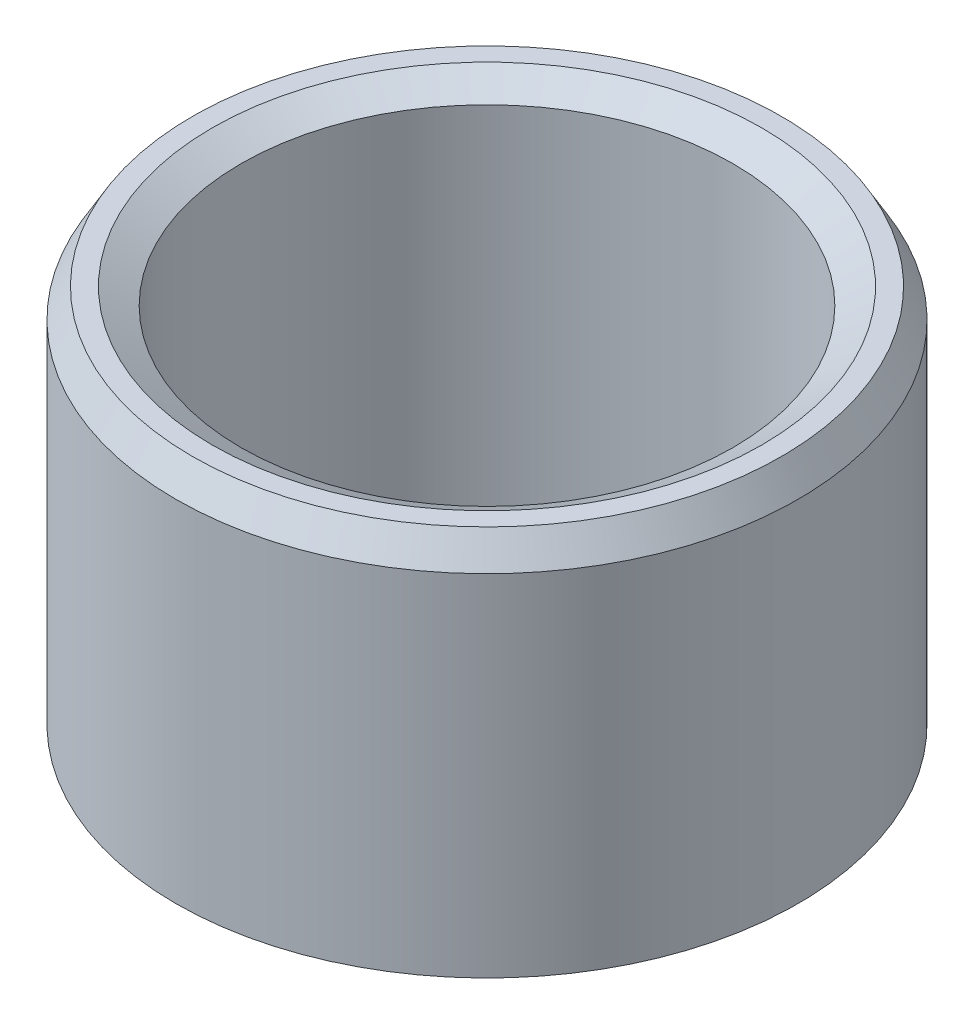
ISO-10303-21;
HEADER;
FILE_DESCRIPTION(('STEP AP214'),'2;1');
FILE_NAME('part.step','',(''),(''),'','','');
FILE_SCHEMA(('AUTOMOTIVE_DESIGN { 1 0 10303 214 1 1 1 1 }'));
ENDSEC;
DATA;
#1=APPLICATION_CONTEXT('core data for automotive mechanical design processes');
#2=APPLICATION_PROTOCOL_DEFINITION('international standard','automotive_design',2000,#1);
#3=PRODUCT_CONTEXT('',#1,'mechanical');
#4=PRODUCT('Part','Part','',(#3));
#5=PRODUCT_RELATED_PRODUCT_CATEGORY('part','',(#4));
#6=PRODUCT_DEFINITION_FORMATION('','',#4);
#7=PRODUCT_DEFINITION_CONTEXT('part definition',#1,'design');
#8=PRODUCT_DEFINITION('design','',#6,#7);
#9=PRODUCT_DEFINITION_SHAPE('','',#8);
#10=(LENGTH_UNIT() NAMED_UNIT(*) SI_UNIT(.MILLI.,.METRE.));
#11=(NAMED_UNIT(*) PLANE_ANGLE_UNIT() SI_UNIT($,.RADIAN.));
#12=(NAMED_UNIT(*) SI_UNIT($,.STERADIAN.) SOLID_ANGLE_UNIT());
#13=UNCERTAINTY_MEASURE_WITH_UNIT(LENGTH_MEASURE(1.E-05),#10,'distance_accuracy_value','');
#14=(GEOMETRIC_REPRESENTATION_CONTEXT(3) GLOBAL_UNCERTAINTY_ASSIGNED_CONTEXT((#13)) GLOBAL_UNIT_ASSIGNED_CONTEXT((#10,
#11,#12)) REPRESENTATION_CONTEXT('',''));
#15=CARTESIAN_POINT('',(0.,0.,0.));
#16=DIRECTION('',(0.,0.,1.));
#17=DIRECTION('',(1.,0.,0.));
#18=AXIS2_PLACEMENT_3D('',#15,#16,#17);
#19=CARTESIAN_POINT('',(0.,31.7757014943486,0.));
#20=DIRECTION('',(0.,-1.,0.));
#21=DIRECTION('',(0.,0.,-1.));
#22=AXIS2_PLACEMENT_3D('',#19,#20,#21);
#23=CYLINDRICAL_SURFACE('',#22,25.);
#24=CARTESIAN_POINT('',(0.,1.33484252682352,0.));
#25=DIRECTION('',(0.,1.,0.));
#26=DIRECTION('',(0.,0.,1.));
#27=AXIS2_PLACEMENT_3D('',#24,#25,#26);
#28=CIRCLE('',#27,25.);
#29=CARTESIAN_POINT('',(0.,1.33484252682352,25.));
#30=VERTEX_POINT('',#29);
#31=EDGE_CURVE('E10',#30,#30,#28,.T.);
#32=ORIENTED_EDGE('',*,*,#31,.T.);
#33=EDGE_LOOP('',(#32));
#34=FACE_BOUND('',#33,.T.);
#35=CARTESIAN_POINT('',(0.,29.4636864177866,0.));
#36=DIRECTION('',(0.,1.,0.));
#37=DIRECTION('',(0.,0.,1.));
#38=AXIS2_PLACEMENT_3D('',#35,#36,#37);
#39=CIRCLE('',#38,25.);
#40=CARTESIAN_POINT('',(0.,29.4636864177866,25.));
#41=VERTEX_POINT('',#40);
#42=EDGE_CURVE('E50',#41,#41,#39,.F.);
#43=ORIENTED_EDGE('',*,*,#42,.T.);
#44=EDGE_LOOP('',(#43));
#45=FACE_BOUND('',#44,.T.);
#46=ADVANCED_FACE('F39',(#34,#45),#23,.T.);
#47=CARTESIAN_POINT('',(0.,31.7757014943486,0.));
#48=DIRECTION('',(0.,1.,0.));
#49=DIRECTION('',(0.,0.,1.));
#50=AXIS2_PLACEMENT_3D('',#47,#48,#49);
#51=PLANE('',#50);
#52=CARTESIAN_POINT('',(0.,31.7757014943486,0.));
#53=DIRECTION('',(0.,1.,0.));
#54=DIRECTION('',(0.,0.,1.));
#55=AXIS2_PLACEMENT_3D('',#52,#53,#54);
#56=CIRCLE('',#55,22.0734774963139);
#57=CARTESIAN_POINT('',(0.,31.7757014943486,22.0734774963139));
#58=VERTEX_POINT('',#57);
#59=EDGE_CURVE('E58',#58,#58,#56,.F.);
#60=ORIENTED_EDGE('',*,*,#59,.T.);
#61=EDGE_LOOP('',(#60));
#62=FACE_BOUND('',#61,.T.);
#63=CARTESIAN_POINT('',(0.,31.7757014943486,0.));
#64=DIRECTION('',(0.,1.,0.));
#65=DIRECTION('',(0.,0.,1.));
#66=AXIS2_PLACEMENT_3D('',#63,#64,#65);
#67=CIRCLE('',#66,23.6651574731765);
#68=CARTESIAN_POINT('',(0.,31.7757014943486,23.6651574731765));
#69=VERTEX_POINT('',#68);
#70=EDGE_CURVE('E61',#69,#69,#67,.T.);
#71=ORIENTED_EDGE('',*,*,#70,.T.);
#72=EDGE_LOOP('',(#71));
#73=FACE_BOUND('',#72,.T.);
#74=ADVANCED_FACE('F88',(#62,#73),#51,.T.);
#75=CARTESIAN_POINT('',(0.,0.,0.));
#76=DIRECTION('',(0.,1.,0.));
#77=DIRECTION('',(0.,0.,1.));
#78=AXIS2_PLACEMENT_3D('',#75,#76,#77);
#79=PLANE('',#78);
#80=CARTESIAN_POINT('',(0.,0.,0.));
#81=DIRECTION('',(0.,1.,0.));
#82=DIRECTION('',(0.,0.,1.));
#83=AXIS2_PLACEMENT_3D('',#80,#81,#82);
#84=CIRCLE('',#83,21.0963049465754);
#85=CARTESIAN_POINT('',(0.,0.,21.0963049465754));
#86=VERTEX_POINT('',#85);
#87=EDGE_CURVE('E51',#86,#86,#84,.T.);
#88=ORIENTED_EDGE('',*,*,#87,.T.);
#89=EDGE_LOOP('',(#88));
#90=FACE_BOUND('',#89,.T.);
#91=CARTESIAN_POINT('',(0.,0.,0.));
#92=DIRECTION('',(0.,1.,0.));
#93=DIRECTION('',(0.,0.,1.));
#94=AXIS2_PLACEMENT_3D('',#91,#92,#93);
#95=CIRCLE('',#94,22.687984923438);
#96=CARTESIAN_POINT('',(0.,0.,22.687984923438));
#97=VERTEX_POINT('',#96);
#98=EDGE_CURVE('E54',#97,#97,#95,.F.);
#99=ORIENTED_EDGE('',*,*,#98,.T.);
#100=EDGE_LOOP('',(#99));
#101=FACE_BOUND('',#100,.T.);
#102=ADVANCED_FACE('F83',(#90,#101),#79,.F.);
#103=CARTESIAN_POINT('',(0.,31.7757014943486,0.));
#104=DIRECTION('',(0.,-1.,0.));
#105=DIRECTION('',(0.,0.,-1.));
#106=AXIS2_PLACEMENT_3D('',#103,#104,#105);
#107=CYLINDRICAL_SURFACE('',#106,19.7614624197519);
#108=CARTESIAN_POINT('',(0.,30.4408589675251,0.));
#109=DIRECTION('',(0.,1.,0.));
#110=DIRECTION('',(0.,0.,1.));
#111=AXIS2_PLACEMENT_3D('',#108,#109,#110);
#112=CIRCLE('',#111,19.7614624197519);
#113=CARTESIAN_POINT('',(0.,30.4408589675251,19.7614624197519));
#114=VERTEX_POINT('',#113);
#115=EDGE_CURVE('E67',#114,#114,#112,.T.);
#116=ORIENTED_EDGE('',*,*,#115,.T.);
#117=EDGE_LOOP('',(#116));
#118=FACE_BOUND('',#117,.T.);
#119=CARTESIAN_POINT('',(0.,2.31201507656197,0.));
#120=DIRECTION('',(0.,1.,0.));
#121=DIRECTION('',(0.,0.,1.));
#122=AXIS2_PLACEMENT_3D('',#119,#120,#121);
#123=CIRCLE('',#122,19.7614624197519);
#124=CARTESIAN_POINT('',(0.,2.31201507656197,19.7614624197519));
#125=VERTEX_POINT('',#124);
#126=EDGE_CURVE('E69',#125,#125,#123,.F.);
#127=ORIENTED_EDGE('',*,*,#126,.T.);
#128=EDGE_LOOP('',(#127));
#129=FACE_BOUND('',#128,.T.);
#130=ADVANCED_FACE('F71',(#118,#129),#107,.F.);
#131=CARTESIAN_POINT('',(0.,30.4408589675251,0.));
#132=DIRECTION('',(0.,1.,0.));
#133=DIRECTION('',(0.,0.,1.));
#134=AXIS2_PLACEMENT_3D('',#131,#132,#133);
#135=CONICAL_SURFACE('',#134,19.7614624197519,1.0471975511966);
#136=ORIENTED_EDGE('',*,*,#59,.F.);
#137=EDGE_LOOP('',(#136));
#138=FACE_BOUND('',#137,.T.);
#139=ORIENTED_EDGE('',*,*,#115,.F.);
#140=EDGE_LOOP('',(#139));
#141=FACE_BOUND('',#140,.T.);
#142=ADVANCED_FACE('F77',(#138,#141),#135,.F.);
#143=CARTESIAN_POINT('',(0.,0.,0.));
#144=DIRECTION('',(0.,-1.,0.));
#145=DIRECTION('',(0.,0.,-1.));
#146=AXIS2_PLACEMENT_3D('',#143,#144,#145);
#147=CONICAL_SURFACE('',#146,21.0963049465754,0.523598775598294);
#148=ORIENTED_EDGE('',*,*,#126,.F.);
#149=EDGE_LOOP('',(#148));
#150=FACE_BOUND('',#149,.T.);
#151=ORIENTED_EDGE('',*,*,#87,.F.);
#152=EDGE_LOOP('',(#151));
#153=FACE_BOUND('',#152,.T.);
#154=ADVANCED_FACE('F73',(#150,#153),#147,.F.);
#155=CARTESIAN_POINT('',(0.,1.33484252682352,0.));
#156=DIRECTION('',(0.,1.,0.));
#157=DIRECTION('',(0.,0.,1.));
#158=AXIS2_PLACEMENT_3D('',#155,#156,#157);
#159=CONICAL_SURFACE('',#158,25.,1.0471975511966);
#160=CARTESIAN_POINT('',(0.,0.,22.687984923438));
#161=CARTESIAN_POINT('',(0.,0.0139046096544115,22.7120684138189));
#162=CARTESIAN_POINT('',(0.,0.0278092193088231,22.7361519041997));
#163=CARTESIAN_POINT('',(0.,0.0556184386176464,22.7843188849614));
#164=CARTESIAN_POINT('',(0.,0.069523048272058,22.8084023753423));
#165=CARTESIAN_POINT('',(0.,0.0973322675808813,22.856569356104));
#166=CARTESIAN_POINT('',(0.,0.111236877235293,22.8806528464849));
#167=CARTESIAN_POINT('',(0.,0.139046096544116,22.9288198272466));
#168=CARTESIAN_POINT('',(0.,0.152950706198528,22.9529033176274));
#169=CARTESIAN_POINT('',(0.,0.180759925507351,23.0010702983891));
#170=CARTESIAN_POINT('',(0.,0.194664535161763,23.02515378877));
#171=CARTESIAN_POINT('',(0.,0.222473754470586,23.0733207695317));
#172=CARTESIAN_POINT('',(0.,0.236378364124998,23.0974042599125));
#173=CARTESIAN_POINT('',(0.,0.264187583433821,23.1455712406743));
#174=CARTESIAN_POINT('',(0.,0.278092193088233,23.1696547310551));
#175=CARTESIAN_POINT('',(0.,0.305901412397056,23.2178217118168));
#176=CARTESIAN_POINT('',(0.,0.319806022051468,23.2419052021977));
#177=CARTESIAN_POINT('',(0.,0.347615241360291,23.2900721829594));
#178=CARTESIAN_POINT('',(0.,0.361519851014703,23.3141556733402));
#179=CARTESIAN_POINT('',(0.,0.389329070323526,23.3623226541019));
#180=CARTESIAN_POINT('',(0.,0.403233679977937,23.3864061444828));
#181=CARTESIAN_POINT('',(0.,0.431042899286761,23.4345731252445));
#182=CARTESIAN_POINT('',(0.,0.444947508941172,23.4586566156254));
#183=CARTESIAN_POINT('',(0.,0.472756728249996,23.5068235963871));
#184=CARTESIAN_POINT('',(0.,0.486661337904407,23.5309070867679));
#185=CARTESIAN_POINT('',(0.,0.514470557213231,23.5790740675296));
#186=CARTESIAN_POINT('',(0.,0.528375166867642,23.6031575579105));
#187=CARTESIAN_POINT('',(0.,0.556184386176466,23.6513245386722));
#188=CARTESIAN_POINT('',(0.,0.570088995830877,23.675408029053));
#189=CARTESIAN_POINT('',(0.,0.597898215139701,23.7235750098147));
#190=CARTESIAN_POINT('',(0.,0.611802824794112,23.7476585001956));
#191=CARTESIAN_POINT('',(0.,0.639612044102935,23.7958254809573));
#192=CARTESIAN_POINT('',(0.,0.653516653757347,23.8199089713382));
#193=CARTESIAN_POINT('',(0.,0.68132587306617,23.8680759520999));
#194=CARTESIAN_POINT('',(0.,0.695230482720582,23.8921594424807));
#195=CARTESIAN_POINT('',(0.,0.723039702029405,23.9403264232424));
#196=CARTESIAN_POINT('',(0.,0.736944311683817,23.9644099136233));
#197=CARTESIAN_POINT('',(0.,0.76475353099264,24.012576894385));
#198=CARTESIAN_POINT('',(0.,0.778658140647052,24.0366603847658));
#199=CARTESIAN_POINT('',(0.,0.806467359955875,24.0848273655276));
#200=CARTESIAN_POINT('',(0.,0.820371969610287,24.1089108559084));
#201=CARTESIAN_POINT('',(0.,0.84818118891911,24.1570778366701));
#202=CARTESIAN_POINT('',(0.,0.862085798573522,24.181161327051));
#203=CARTESIAN_POINT('',(0.,0.889895017882345,24.2293283078127));
#204=CARTESIAN_POINT('',(0.,0.903799627536757,24.2534117981935));
#205=CARTESIAN_POINT('',(0.,0.93160884684558,24.3015787789552));
#206=CARTESIAN_POINT('',(0.,0.945513456499992,24.3256622693361));
#207=CARTESIAN_POINT('',(0.,0.973322675808815,24.3738292500978));
#208=CARTESIAN_POINT('',(0.,0.987227285463227,24.3979127404787));
#209=CARTESIAN_POINT('',(0.,1.01503650477205,24.4460797212404));
#210=CARTESIAN_POINT('',(0.,1.02894111442646,24.4701632116212));
#211=CARTESIAN_POINT('',(0.,1.05675033373529,24.5183301923829));
#212=CARTESIAN_POINT('',(0.,1.0706549433897,24.5424136827638));
#213=CARTESIAN_POINT('',(0.,1.09846416269852,24.5905806635255));
#214=CARTESIAN_POINT('',(0.,1.11236877235293,24.6146641539063));
#215=CARTESIAN_POINT('',(0.,1.14017799166175,24.662831134668));
#216=CARTESIAN_POINT('',(0.,1.15408260131617,24.6869146250489));
#217=CARTESIAN_POINT('',(0.,1.18189182062499,24.7350816058106));
#218=CARTESIAN_POINT('',(0.,1.1957964302794,24.7591650961915));
#219=CARTESIAN_POINT('',(0.,1.22360564958822,24.8073320769532));
#220=CARTESIAN_POINT('',(0.,1.23751025924264,24.831415567334));
#221=CARTESIAN_POINT('',(0.,1.26531947855146,24.8795825480957));
#222=CARTESIAN_POINT('',(0.,1.27922408820587,24.9036660384766));
#223=CARTESIAN_POINT('',(0.,1.30703330751469,24.9518330192383));
#224=CARTESIAN_POINT('',(0.,1.32093791716911,24.9759165096191));
#225=CARTESIAN_POINT('',(0.,1.33484252682352,25.));
#226=B_SPLINE_CURVE_WITH_KNOTS('',3,(#160,#161,#162,#163,#164,#165,#166,#167,#168,#169,#170,
#171,#172,#173,#174,#175,#176,#177,#178,#179,#180,#181,#182,#183,#184,#185,#186,#187,#188,#189,
#190,#191,#192,#193,#194,#195,#196,#197,#198,#199,#200,#201,#202,#203,#204,#205,#206,#207,#208,
#209,#210,#211,#212,#213,#214,#215,#216,#217,#218,#219,#220,#221,#222,#223,#224,#225),
.UNSPECIFIED.,.F.,.F.,(4,2,2,2,2,2,2,2,2,2,2,2,2,2,2,2,2,2,2,2,2,2,2,2,2,2,2,2,2,2,2,2,4),(0.,
0.0834276579264705,0.166855315852941,0.250282973779412,0.333710631705882,0.41713828963235,
0.50056594755882,0.583993605485291,0.667421263411761,0.750848921338232,0.834276579264702,
0.917704237191173,1.00113189511764,1.08455955304411,1.16798721097058,1.25141486889705,
1.33484252682353,1.41827018475,1.50169784267647,1.58512550060294,1.66855315852941,
1.75198081645588,1.83540847438235,1.91883613230882,2.00226379023529,2.08569144816176,
2.16911910608823,2.2525467640147,2.33597442194117,2.41940207986764,2.50282973779411,
2.58625739572058,2.66968505364705),.UNSPECIFIED.);
#227=EDGE_CURVE('BSEAM76',#97,#30,#226,.T.);
#228=ORIENTED_EDGE('',*,*,#98,.F.);
#229=ORIENTED_EDGE('',*,*,#31,.F.);
#230=ORIENTED_EDGE('',*,*,#227,.T.);
#231=ORIENTED_EDGE('',*,*,#227,.F.);
#232=EDGE_LOOP('',(#228,#230,#229,#231));
#233=FACE_BOUND('',#232,.T.);
#234=ADVANCED_FACE('F76',(#233),#159,.T.);
#235=CARTESIAN_POINT('',(0.,31.7757014943486,0.));
#236=DIRECTION('',(0.,-1.,0.));
#237=DIRECTION('',(0.,0.,-1.));
#238=AXIS2_PLACEMENT_3D('',#235,#236,#237);
#239=CONICAL_SURFACE('',#238,23.6651574731765,0.523598775598293);
#240=ORIENTED_EDGE('',*,*,#42,.F.);
#241=EDGE_LOOP('',(#240));
#242=FACE_BOUND('',#241,.T.);
#243=ORIENTED_EDGE('',*,*,#70,.F.);
#244=EDGE_LOOP('',(#243));
#245=FACE_BOUND('',#244,.T.);
#246=ADVANCED_FACE('F45',(#242,#245),#239,.T.);
#247=CLOSED_SHELL('',(#46,#74,#102,#130,#142,#154,#234,#246));
#248=MANIFOLD_SOLID_BREP('B2',#247);
#249=ADVANCED_BREP_SHAPE_REPRESENTATION('',(#18,#248),#14);
#250=SHAPE_DEFINITION_REPRESENTATION(#9,#249);
ENDSEC;
END-ISO-10303-21;
